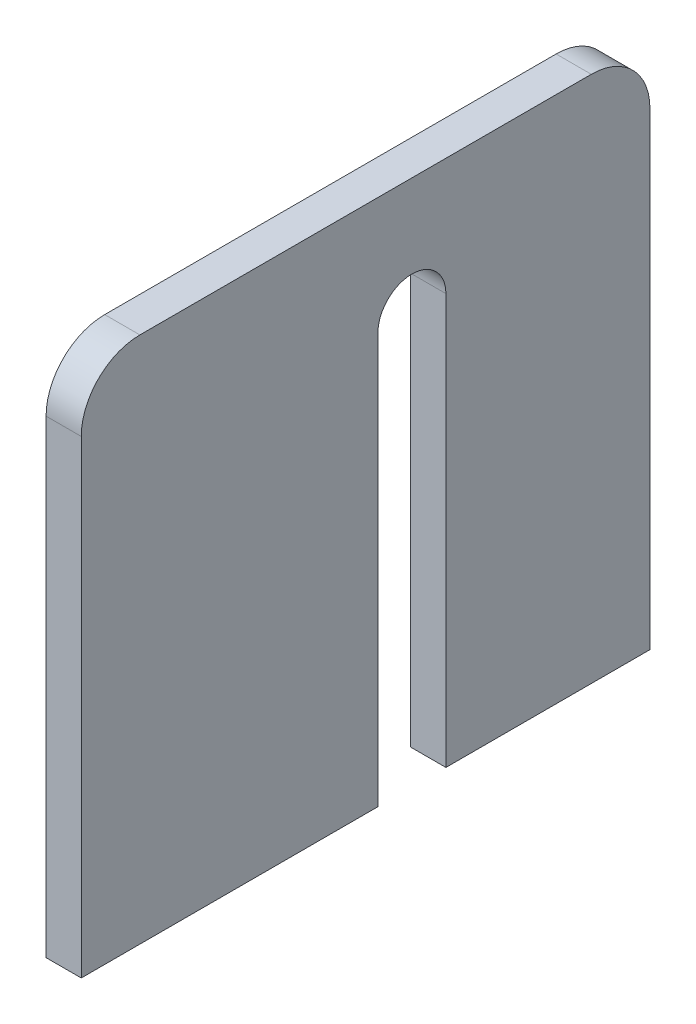
ISO-10303-21;
HEADER;
FILE_DESCRIPTION(('STEP AP214'),'2;1');
FILE_NAME('part.step','',(''),(''),'','','');
FILE_SCHEMA(('AUTOMOTIVE_DESIGN { 1 0 10303 214 1 1 1 1 }'));
ENDSEC;
DATA;
#1=APPLICATION_CONTEXT('core data for automotive mechanical design processes');
#2=APPLICATION_PROTOCOL_DEFINITION('international standard','automotive_design',2000,#1);
#3=PRODUCT_CONTEXT('',#1,'mechanical');
#4=PRODUCT('Part','Part','',(#3));
#5=PRODUCT_RELATED_PRODUCT_CATEGORY('part','',(#4));
#6=PRODUCT_DEFINITION_FORMATION('','',#4);
#7=PRODUCT_DEFINITION_CONTEXT('part definition',#1,'design');
#8=PRODUCT_DEFINITION('design','',#6,#7);
#9=PRODUCT_DEFINITION_SHAPE('','',#8);
#10=(LENGTH_UNIT() NAMED_UNIT(*) SI_UNIT(.MILLI.,.METRE.));
#11=(NAMED_UNIT(*) PLANE_ANGLE_UNIT() SI_UNIT($,.RADIAN.));
#12=(NAMED_UNIT(*) SI_UNIT($,.STERADIAN.) SOLID_ANGLE_UNIT());
#13=UNCERTAINTY_MEASURE_WITH_UNIT(LENGTH_MEASURE(1.E-05),#10,'distance_accuracy_value','');
#14=(GEOMETRIC_REPRESENTATION_CONTEXT(3) GLOBAL_UNCERTAINTY_ASSIGNED_CONTEXT((#13)) GLOBAL_UNIT_ASSIGNED_CONTEXT((#10,
#11,#12)) REPRESENTATION_CONTEXT('',''));
#15=CARTESIAN_POINT('',(0.,0.,0.));
#16=DIRECTION('',(0.,0.,1.));
#17=DIRECTION('',(1.,0.,0.));
#18=AXIS2_PLACEMENT_3D('',#15,#16,#17);
#19=CARTESIAN_POINT('',(3.,0.,0.));
#20=DIRECTION('',(0.,1.,0.));
#21=DIRECTION('',(0.,0.,1.));
#22=AXIS2_PLACEMENT_3D('',#19,#20,#21);
#23=PLANE('',#22);
#24=DIRECTION('',(0.,0.,-1.));
#25=VECTOR('',#24,1.);
#26=CARTESIAN_POINT('',(3.,0.,0.));
#27=LINE('',#26,#25);
#28=CARTESIAN_POINT('',(3.,0.,-31.1));
#29=VERTEX_POINT('',#28);
#30=CARTESIAN_POINT('',(3.,0.,-48.5));
#31=VERTEX_POINT('',#30);
#32=EDGE_CURVE('E154',#29,#31,#27,.T.);
#33=ORIENTED_EDGE('',*,*,#32,.F.);
#34=DIRECTION('',(1.,0.,0.));
#35=VECTOR('',#34,1.);
#36=CARTESIAN_POINT('',(0.,0.,-31.1));
#37=LINE('',#36,#35);
#38=CARTESIAN_POINT('',(0.,0.,-31.1));
#39=VERTEX_POINT('',#38);
#40=EDGE_CURVE('E149',#39,#29,#37,.T.);
#41=ORIENTED_EDGE('',*,*,#40,.F.);
#42=DIRECTION('',(0.,0.,-1.));
#43=VECTOR('',#42,1.);
#44=CARTESIAN_POINT('',(0.,0.,0.));
#45=LINE('',#44,#43);
#46=CARTESIAN_POINT('',(0.,0.,-48.5));
#47=VERTEX_POINT('',#46);
#48=EDGE_CURVE('E165',#39,#47,#45,.T.);
#49=ORIENTED_EDGE('',*,*,#48,.T.);
#50=DIRECTION('',(-1.,0.,0.));
#51=VECTOR('',#50,1.);
#52=CARTESIAN_POINT('',(3.,0.,-48.5));
#53=LINE('',#52,#51);
#54=EDGE_CURVE('E163',#31,#47,#53,.T.);
#55=ORIENTED_EDGE('',*,*,#54,.F.);
#56=EDGE_LOOP('',(#33,#41,#49,#55));
#57=FACE_BOUND('',#56,.T.);
#58=ADVANCED_FACE('F33',(#57),#23,.F.);
#59=CARTESIAN_POINT('',(3.,0.,0.));
#60=DIRECTION('',(0.,0.,-1.));
#61=DIRECTION('',(-1.,0.,0.));
#62=AXIS2_PLACEMENT_3D('',#59,#60,#61);
#63=PLANE('',#62);
#64=DIRECTION('',(0.,-1.,0.));
#65=VECTOR('',#64,1.);
#66=CARTESIAN_POINT('',(3.,0.,0.));
#67=LINE('',#66,#65);
#68=CARTESIAN_POINT('',(3.,40.,0.));
#69=VERTEX_POINT('',#68);
#70=CARTESIAN_POINT('',(3.,0.,0.));
#71=VERTEX_POINT('',#70);
#72=EDGE_CURVE('E152',#69,#71,#67,.T.);
#73=ORIENTED_EDGE('',*,*,#72,.F.);
#74=DIRECTION('',(-1.,0.,0.));
#75=VECTOR('',#74,1.);
#76=CARTESIAN_POINT('',(3.,40.,0.));
#77=LINE('',#76,#75);
#78=CARTESIAN_POINT('',(0.,40.,0.));
#79=VERTEX_POINT('',#78);
#80=EDGE_CURVE('E11',#69,#79,#77,.T.);
#81=ORIENTED_EDGE('',*,*,#80,.T.);
#82=DIRECTION('',(0.,-1.,0.));
#83=VECTOR('',#82,1.);
#84=CARTESIAN_POINT('',(0.,0.,0.));
#85=LINE('',#84,#83);
#86=CARTESIAN_POINT('',(0.,0.,0.));
#87=VERTEX_POINT('',#86);
#88=EDGE_CURVE('E148',#79,#87,#85,.T.);
#89=ORIENTED_EDGE('',*,*,#88,.T.);
#90=DIRECTION('',(-1.,0.,0.));
#91=VECTOR('',#90,1.);
#92=CARTESIAN_POINT('',(3.,0.,0.));
#93=LINE('',#92,#91);
#94=EDGE_CURVE('E174',#71,#87,#93,.T.);
#95=ORIENTED_EDGE('',*,*,#94,.F.);
#96=EDGE_LOOP('',(#73,#81,#89,#95));
#97=FACE_BOUND('',#96,.T.);
#98=ADVANCED_FACE('F211',(#97),#63,.F.);
#99=CARTESIAN_POINT('',(0.,0.,-25.3));
#100=VERTEX_POINT('',#99);
#101=EDGE_CURVE('E166',#87,#100,#45,.T.);
#102=ORIENTED_EDGE('',*,*,#101,.T.);
#103=DIRECTION('',(1.,0.,0.));
#104=VECTOR('',#103,1.);
#105=CARTESIAN_POINT('',(0.,0.,-25.3));
#106=LINE('',#105,#104);
#107=CARTESIAN_POINT('',(3.,0.,-25.3));
#108=VERTEX_POINT('',#107);
#109=EDGE_CURVE('E123',#100,#108,#106,.T.);
#110=ORIENTED_EDGE('',*,*,#109,.T.);
#111=EDGE_CURVE('E156',#71,#108,#27,.T.);
#112=ORIENTED_EDGE('',*,*,#111,.F.);
#113=ORIENTED_EDGE('',*,*,#94,.T.);
#114=EDGE_LOOP('',(#102,#110,#112,#113));
#115=FACE_BOUND('',#114,.T.);
#116=ADVANCED_FACE('F207',(#115),#23,.F.);
#117=CARTESIAN_POINT('',(3.,0.,-48.5));
#118=DIRECTION('',(0.,0.,1.));
#119=DIRECTION('',(1.,0.,0.));
#120=AXIS2_PLACEMENT_3D('',#117,#118,#119);
#121=PLANE('',#120);
#122=DIRECTION('',(0.,1.,0.));
#123=VECTOR('',#122,1.);
#124=CARTESIAN_POINT('',(0.,0.,-48.5));
#125=LINE('',#124,#123);
#126=CARTESIAN_POINT('',(0.,40.,-48.5));
#127=VERTEX_POINT('',#126);
#128=EDGE_CURVE('E168',#47,#127,#125,.T.);
#129=ORIENTED_EDGE('',*,*,#128,.T.);
#130=DIRECTION('',(-1.,0.,0.));
#131=VECTOR('',#130,1.);
#132=CARTESIAN_POINT('',(3.,40.,-48.5));
#133=LINE('',#132,#131);
#134=CARTESIAN_POINT('',(3.,40.,-48.5));
#135=VERTEX_POINT('',#134);
#136=EDGE_CURVE('E56',#127,#135,#133,.F.);
#137=ORIENTED_EDGE('',*,*,#136,.T.);
#138=DIRECTION('',(0.,1.,0.));
#139=VECTOR('',#138,1.);
#140=CARTESIAN_POINT('',(3.,0.,-48.5));
#141=LINE('',#140,#139);
#142=EDGE_CURVE('E159',#31,#135,#141,.T.);
#143=ORIENTED_EDGE('',*,*,#142,.F.);
#144=ORIENTED_EDGE('',*,*,#54,.T.);
#145=EDGE_LOOP('',(#129,#137,#143,#144));
#146=FACE_BOUND('',#145,.T.);
#147=ADVANCED_FACE('F197',(#146),#121,.F.);
#148=CARTESIAN_POINT('',(3.,45.,0.));
#149=DIRECTION('',(0.,-1.,0.));
#150=DIRECTION('',(0.,0.,-1.));
#151=AXIS2_PLACEMENT_3D('',#148,#149,#150);
#152=PLANE('',#151);
#153=DIRECTION('',(0.,0.,1.));
#154=VECTOR('',#153,1.);
#155=CARTESIAN_POINT('',(3.,45.,0.));
#156=LINE('',#155,#154);
#157=CARTESIAN_POINT('',(3.,45.,-43.5));
#158=VERTEX_POINT('',#157);
#159=CARTESIAN_POINT('',(3.,45.,-5.));
#160=VERTEX_POINT('',#159);
#161=EDGE_CURVE('E161',#158,#160,#156,.T.);
#162=ORIENTED_EDGE('',*,*,#161,.F.);
#163=DIRECTION('',(-1.,0.,0.));
#164=VECTOR('',#163,1.);
#165=CARTESIAN_POINT('',(3.,45.,-43.5));
#166=LINE('',#165,#164);
#167=CARTESIAN_POINT('',(0.,45.,-43.5));
#168=VERTEX_POINT('',#167);
#169=EDGE_CURVE('E179',#158,#168,#166,.T.);
#170=ORIENTED_EDGE('',*,*,#169,.T.);
#171=DIRECTION('',(0.,0.,1.));
#172=VECTOR('',#171,1.);
#173=CARTESIAN_POINT('',(0.,45.,0.));
#174=LINE('',#173,#172);
#175=CARTESIAN_POINT('',(0.,45.,-5.));
#176=VERTEX_POINT('',#175);
#177=EDGE_CURVE('E155',#168,#176,#174,.T.);
#178=ORIENTED_EDGE('',*,*,#177,.T.);
#179=DIRECTION('',(-1.,0.,0.));
#180=VECTOR('',#179,1.);
#181=CARTESIAN_POINT('',(3.,45.,-5.));
#182=LINE('',#181,#180);
#183=EDGE_CURVE('E177',#176,#160,#182,.F.);
#184=ORIENTED_EDGE('',*,*,#183,.T.);
#185=EDGE_LOOP('',(#162,#170,#178,#184));
#186=FACE_BOUND('',#185,.T.);
#187=ADVANCED_FACE('F193',(#186),#152,.F.);
#188=CARTESIAN_POINT('',(3.,0.,0.));
#189=DIRECTION('',(-1.,0.,0.));
#190=DIRECTION('',(0.,0.,1.));
#191=AXIS2_PLACEMENT_3D('',#188,#189,#190);
#192=PLANE('',#191);
#193=ORIENTED_EDGE('',*,*,#142,.T.);
#194=CARTESIAN_POINT('',(3.,40.,-43.5));
#195=DIRECTION('',(-1.,0.,0.));
#196=DIRECTION('',(0.,0.,1.));
#197=AXIS2_PLACEMENT_3D('',#194,#195,#196);
#198=CIRCLE('',#197,5.);
#199=EDGE_CURVE('E41',#135,#158,#198,.F.);
#200=ORIENTED_EDGE('',*,*,#199,.T.);
#201=ORIENTED_EDGE('',*,*,#161,.T.);
#202=CARTESIAN_POINT('',(3.,40.,-5.));
#203=DIRECTION('',(-1.,0.,0.));
#204=DIRECTION('',(0.,0.,1.));
#205=AXIS2_PLACEMENT_3D('',#202,#203,#204);
#206=CIRCLE('',#205,5.);
#207=EDGE_CURVE('E48',#160,#69,#206,.F.);
#208=ORIENTED_EDGE('',*,*,#207,.T.);
#209=ORIENTED_EDGE('',*,*,#72,.T.);
#210=ORIENTED_EDGE('',*,*,#111,.T.);
#211=DIRECTION('',(0.,-1.,0.));
#212=VECTOR('',#211,1.);
#213=CARTESIAN_POINT('',(3.,35.,-25.3));
#214=LINE('',#213,#212);
#215=CARTESIAN_POINT('',(3.,35.,-25.3));
#216=VERTEX_POINT('',#215);
#217=EDGE_CURVE('E140',#216,#108,#214,.T.);
#218=ORIENTED_EDGE('',*,*,#217,.F.);
#219=CARTESIAN_POINT('',(3.,35.,-28.2));
#220=DIRECTION('',(1.,0.,0.));
#221=DIRECTION('',(0.,0.,-1.));
#222=AXIS2_PLACEMENT_3D('',#219,#220,#221);
#223=CIRCLE('',#222,2.9);
#224=CARTESIAN_POINT('',(3.,35.,-31.1));
#225=VERTEX_POINT('',#224);
#226=EDGE_CURVE('E120',#225,#216,#223,.T.);
#227=ORIENTED_EDGE('',*,*,#226,.F.);
#228=DIRECTION('',(0.,1.,0.));
#229=VECTOR('',#228,1.);
#230=CARTESIAN_POINT('',(3.,0.,-31.1));
#231=LINE('',#230,#229);
#232=EDGE_CURVE('E137',#29,#225,#231,.T.);
#233=ORIENTED_EDGE('',*,*,#232,.F.);
#234=ORIENTED_EDGE('',*,*,#32,.T.);
#235=EDGE_LOOP('',(#193,#200,#201,#208,#209,#210,#218,#227,#233,#234));
#236=FACE_BOUND('',#235,.T.);
#237=ADVANCED_FACE('F189',(#236),#192,.F.);
#238=CARTESIAN_POINT('',(0.,0.,0.));
#239=DIRECTION('',(-1.,0.,0.));
#240=DIRECTION('',(0.,0.,1.));
#241=AXIS2_PLACEMENT_3D('',#238,#239,#240);
#242=PLANE('',#241);
#243=ORIENTED_EDGE('',*,*,#177,.F.);
#244=CARTESIAN_POINT('',(0.,40.,-43.5));
#245=DIRECTION('',(-1.,0.,0.));
#246=DIRECTION('',(0.,0.,1.));
#247=AXIS2_PLACEMENT_3D('',#244,#245,#246);
#248=CIRCLE('',#247,5.);
#249=EDGE_CURVE('E184',#168,#127,#248,.T.);
#250=ORIENTED_EDGE('',*,*,#249,.T.);
#251=ORIENTED_EDGE('',*,*,#128,.F.);
#252=ORIENTED_EDGE('',*,*,#48,.F.);
#253=DIRECTION('',(0.,1.,0.));
#254=VECTOR('',#253,1.);
#255=CARTESIAN_POINT('',(0.,0.,-31.1));
#256=LINE('',#255,#254);
#257=CARTESIAN_POINT('',(0.,35.,-31.1));
#258=VERTEX_POINT('',#257);
#259=EDGE_CURVE('E124',#39,#258,#256,.T.);
#260=ORIENTED_EDGE('',*,*,#259,.T.);
#261=CARTESIAN_POINT('',(0.,35.,-28.2));
#262=DIRECTION('',(1.,0.,0.));
#263=DIRECTION('',(0.,0.,-1.));
#264=AXIS2_PLACEMENT_3D('',#261,#262,#263);
#265=CIRCLE('',#264,2.9);
#266=CARTESIAN_POINT('',(0.,35.,-25.3));
#267=VERTEX_POINT('',#266);
#268=EDGE_CURVE('E117',#258,#267,#265,.T.);
#269=ORIENTED_EDGE('',*,*,#268,.T.);
#270=DIRECTION('',(0.,-1.,0.));
#271=VECTOR('',#270,1.);
#272=CARTESIAN_POINT('',(0.,35.,-25.3));
#273=LINE('',#272,#271);
#274=EDGE_CURVE('E127',#267,#100,#273,.T.);
#275=ORIENTED_EDGE('',*,*,#274,.T.);
#276=ORIENTED_EDGE('',*,*,#101,.F.);
#277=ORIENTED_EDGE('',*,*,#88,.F.);
#278=CARTESIAN_POINT('',(0.,40.,-5.));
#279=DIRECTION('',(-1.,0.,0.));
#280=DIRECTION('',(0.,0.,1.));
#281=AXIS2_PLACEMENT_3D('',#278,#279,#280);
#282=CIRCLE('',#281,5.);
#283=EDGE_CURVE('E182',#79,#176,#282,.T.);
#284=ORIENTED_EDGE('',*,*,#283,.T.);
#285=EDGE_LOOP('',(#243,#250,#251,#252,#260,#269,#275,#276,#277,#284));
#286=FACE_BOUND('',#285,.T.);
#287=ADVANCED_FACE('F135',(#286),#242,.T.);
#288=CARTESIAN_POINT('',(0.,35.,-28.2));
#289=DIRECTION('',(1.,0.,0.));
#290=DIRECTION('',(0.,0.,-1.));
#291=AXIS2_PLACEMENT_3D('',#288,#289,#290);
#292=CYLINDRICAL_SURFACE('',#291,2.9);
#293=ORIENTED_EDGE('',*,*,#226,.T.);
#294=DIRECTION('',(1.,0.,0.));
#295=VECTOR('',#294,1.);
#296=CARTESIAN_POINT('',(0.,35.,-25.3));
#297=LINE('',#296,#295);
#298=EDGE_CURVE('E113',#267,#216,#297,.T.);
#299=ORIENTED_EDGE('',*,*,#298,.F.);
#300=ORIENTED_EDGE('',*,*,#268,.F.);
#301=DIRECTION('',(1.,0.,0.));
#302=VECTOR('',#301,1.);
#303=CARTESIAN_POINT('',(0.,35.,-31.1));
#304=LINE('',#303,#302);
#305=EDGE_CURVE('E146',#258,#225,#304,.T.);
#306=ORIENTED_EDGE('',*,*,#305,.T.);
#307=EDGE_LOOP('',(#293,#299,#300,#306));
#308=FACE_BOUND('',#307,.T.);
#309=ADVANCED_FACE('F115',(#308),#292,.F.);
#310=CARTESIAN_POINT('',(0.,0.,-31.1));
#311=DIRECTION('',(0.,0.,-1.));
#312=DIRECTION('',(0.,1.,0.));
#313=AXIS2_PLACEMENT_3D('',#310,#311,#312);
#314=PLANE('',#313);
#315=ORIENTED_EDGE('',*,*,#232,.T.);
#316=ORIENTED_EDGE('',*,*,#305,.F.);
#317=ORIENTED_EDGE('',*,*,#259,.F.);
#318=ORIENTED_EDGE('',*,*,#40,.T.);
#319=EDGE_LOOP('',(#315,#316,#317,#318));
#320=FACE_BOUND('',#319,.T.);
#321=ADVANCED_FACE('F204',(#320),#314,.F.);
#322=CARTESIAN_POINT('',(0.,35.,-25.3));
#323=DIRECTION('',(0.,0.,1.));
#324=DIRECTION('',(0.,-1.,0.));
#325=AXIS2_PLACEMENT_3D('',#322,#323,#324);
#326=PLANE('',#325);
#327=ORIENTED_EDGE('',*,*,#217,.T.);
#328=ORIENTED_EDGE('',*,*,#109,.F.);
#329=ORIENTED_EDGE('',*,*,#274,.F.);
#330=ORIENTED_EDGE('',*,*,#298,.T.);
#331=EDGE_LOOP('',(#327,#328,#329,#330));
#332=FACE_BOUND('',#331,.T.);
#333=ADVANCED_FACE('F128',(#332),#326,.F.);
#334=CARTESIAN_POINT('',(3.,40.,-43.5));
#335=DIRECTION('',(-1.,0.,0.));
#336=DIRECTION('',(0.,0.,1.));
#337=AXIS2_PLACEMENT_3D('',#334,#335,#336);
#338=CYLINDRICAL_SURFACE('',#337,5.);
#339=ORIENTED_EDGE('',*,*,#199,.F.);
#340=ORIENTED_EDGE('',*,*,#136,.F.);
#341=ORIENTED_EDGE('',*,*,#249,.F.);
#342=ORIENTED_EDGE('',*,*,#169,.F.);
#343=EDGE_LOOP('',(#339,#340,#341,#342));
#344=FACE_BOUND('',#343,.T.);
#345=ADVANCED_FACE('F195',(#344),#338,.T.);
#346=CARTESIAN_POINT('',(3.,40.,-5.));
#347=DIRECTION('',(-1.,0.,0.));
#348=DIRECTION('',(0.,0.,1.));
#349=AXIS2_PLACEMENT_3D('',#346,#347,#348);
#350=CYLINDRICAL_SURFACE('',#349,5.);
#351=ORIENTED_EDGE('',*,*,#207,.F.);
#352=ORIENTED_EDGE('',*,*,#183,.F.);
#353=ORIENTED_EDGE('',*,*,#283,.F.);
#354=ORIENTED_EDGE('',*,*,#80,.F.);
#355=EDGE_LOOP('',(#351,#352,#353,#354));
#356=FACE_BOUND('',#355,.T.);
#357=ADVANCED_FACE('F35',(#356),#350,.T.);
#358=CLOSED_SHELL('',(#58,#98,#116,#147,#187,#237,#287,#309,#321,#333,#345,#357));
#359=MANIFOLD_SOLID_BREP('B2',#358);
#360=ADVANCED_BREP_SHAPE_REPRESENTATION('',(#18,#359),#14);
#361=SHAPE_DEFINITION_REPRESENTATION(#9,#360);
ENDSEC;
END-ISO-10303-21;
